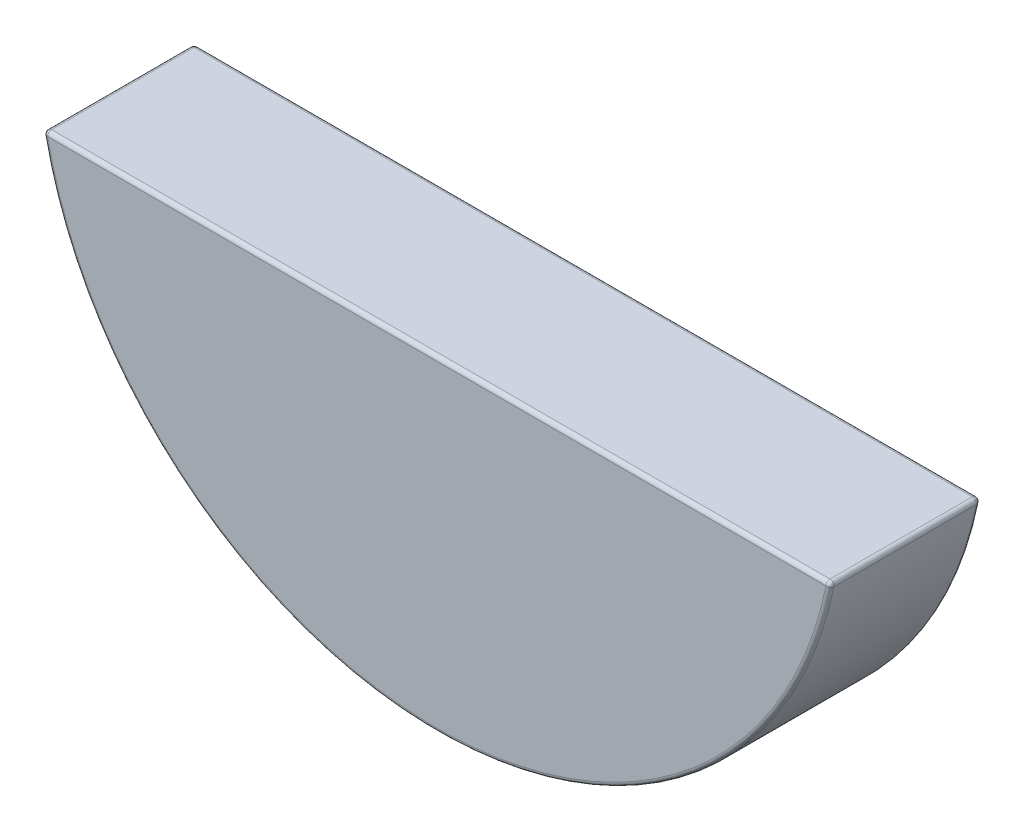
ISO-10303-21;
HEADER;
FILE_DESCRIPTION(('STEP AP214'),'2;1');
FILE_NAME('part.step','',(''),(''),'','','');
FILE_SCHEMA(('AUTOMOTIVE_DESIGN { 1 0 10303 214 1 1 1 1 }'));
ENDSEC;
DATA;
#1=APPLICATION_CONTEXT('core data for automotive mechanical design processes');
#2=APPLICATION_PROTOCOL_DEFINITION('international standard','automotive_design',2000,#1);
#3=PRODUCT_CONTEXT('',#1,'mechanical');
#4=PRODUCT('Part','Part','',(#3));
#5=PRODUCT_RELATED_PRODUCT_CATEGORY('part','',(#4));
#6=PRODUCT_DEFINITION_FORMATION('','',#4);
#7=PRODUCT_DEFINITION_CONTEXT('part definition',#1,'design');
#8=PRODUCT_DEFINITION('design','',#6,#7);
#9=PRODUCT_DEFINITION_SHAPE('','',#8);
#10=(LENGTH_UNIT() NAMED_UNIT(*) SI_UNIT(.MILLI.,.METRE.));
#11=(NAMED_UNIT(*) PLANE_ANGLE_UNIT() SI_UNIT($,.RADIAN.));
#12=(NAMED_UNIT(*) SI_UNIT($,.STERADIAN.) SOLID_ANGLE_UNIT());
#13=UNCERTAINTY_MEASURE_WITH_UNIT(LENGTH_MEASURE(1.E-05),#10,'distance_accuracy_value','');
#14=(GEOMETRIC_REPRESENTATION_CONTEXT(3) GLOBAL_UNCERTAINTY_ASSIGNED_CONTEXT((#13)) GLOBAL_UNIT_ASSIGNED_CONTEXT((#10,
#11,#12)) REPRESENTATION_CONTEXT('',''));
#15=CARTESIAN_POINT('',(0.,0.,0.));
#16=DIRECTION('',(0.,0.,1.));
#17=DIRECTION('',(1.,0.,0.));
#18=AXIS2_PLACEMENT_3D('',#15,#16,#17);
#19=CARTESIAN_POINT('',(0.,0.,2.38125));
#20=DIRECTION('',(0.,0.,-1.));
#21=DIRECTION('',(-1.,0.,0.));
#22=AXIS2_PLACEMENT_3D('',#19,#20,#21);
#23=CYLINDRICAL_SURFACE('',#22,6.35);
#24=DIRECTION('',(0.,0.,-1.));
#25=VECTOR('',#24,1.);
#26=CARTESIAN_POINT('',(6.22170394666927,-1.27,2.38125));
#27=LINE('',#26,#25);
#28=CARTESIAN_POINT('',(6.22170394666927,-1.27,0.0635000000000002));
#29=VERTEX_POINT('',#28);
#30=CARTESIAN_POINT('',(6.22170394666927,-1.27,2.31775));
#31=VERTEX_POINT('',#30);
#32=EDGE_CURVE('E94',#29,#31,#27,.F.);
#33=ORIENTED_EDGE('',*,*,#32,.T.);
#34=CARTESIAN_POINT('',(0.,0.,2.31775));
#35=DIRECTION('',(0.,0.,1.));
#36=DIRECTION('',(1.,0.,0.));
#37=AXIS2_PLACEMENT_3D('',#34,#35,#36);
#38=CIRCLE('',#37,6.35);
#39=CARTESIAN_POINT('',(-6.22170394666927,-1.27,2.31775));
#40=VERTEX_POINT('',#39);
#41=EDGE_CURVE('E126',#31,#40,#38,.F.);
#42=ORIENTED_EDGE('',*,*,#41,.T.);
#43=DIRECTION('',(0.,0.,-1.));
#44=VECTOR('',#43,1.);
#45=CARTESIAN_POINT('',(-6.22170394666927,-1.27,2.38125));
#46=LINE('',#45,#44);
#47=CARTESIAN_POINT('',(-6.22170394666927,-1.27,0.0635000000000002));
#48=VERTEX_POINT('',#47);
#49=EDGE_CURVE('E123',#40,#48,#46,.T.);
#50=ORIENTED_EDGE('',*,*,#49,.T.);
#51=CARTESIAN_POINT('',(0.,0.,0.0635000000000002));
#52=DIRECTION('',(0.,0.,1.));
#53=DIRECTION('',(1.,0.,0.));
#54=AXIS2_PLACEMENT_3D('',#51,#52,#53);
#55=CIRCLE('',#54,6.35);
#56=EDGE_CURVE('E118',#48,#29,#55,.T.);
#57=ORIENTED_EDGE('',*,*,#56,.T.);
#58=EDGE_LOOP('',(#33,#42,#50,#57));
#59=FACE_BOUND('',#58,.T.);
#60=ADVANCED_FACE('F33',(#59),#23,.T.);
#61=CARTESIAN_POINT('',(-6.23677332921439,-1.1938,2.38125));
#62=DIRECTION('',(0.,-1.,0.));
#63=DIRECTION('',(0.,0.,-1.));
#64=AXIS2_PLACEMENT_3D('',#61,#62,#63);
#65=PLANE('',#64);
#66=DIRECTION('',(0.,0.,-1.));
#67=VECTOR('',#66,1.);
#68=CARTESIAN_POINT('',(-6.15948690720258,-1.1938,2.38125));
#69=LINE('',#68,#67);
#70=CARTESIAN_POINT('',(-6.15948690720258,-1.1938,0.0635000000000002));
#71=VERTEX_POINT('',#70);
#72=CARTESIAN_POINT('',(-6.15948690720258,-1.1938,2.31775));
#73=VERTEX_POINT('',#72);
#74=EDGE_CURVE('E111',#71,#73,#69,.F.);
#75=ORIENTED_EDGE('',*,*,#74,.T.);
#76=DIRECTION('',(-1.,0.,0.));
#77=VECTOR('',#76,1.);
#78=CARTESIAN_POINT('',(6.23677332921439,-1.1938,2.31775));
#79=LINE('',#78,#77);
#80=CARTESIAN_POINT('',(6.15948690720258,-1.1938,2.31775));
#81=VERTEX_POINT('',#80);
#82=EDGE_CURVE('E115',#73,#81,#79,.F.);
#83=ORIENTED_EDGE('',*,*,#82,.T.);
#84=DIRECTION('',(0.,0.,-1.));
#85=VECTOR('',#84,1.);
#86=CARTESIAN_POINT('',(6.15948690720258,-1.1938,2.38125));
#87=LINE('',#86,#85);
#88=CARTESIAN_POINT('',(6.15948690720258,-1.1938,0.0635000000000002));
#89=VERTEX_POINT('',#88);
#90=EDGE_CURVE('E92',#81,#89,#87,.T.);
#91=ORIENTED_EDGE('',*,*,#90,.T.);
#92=DIRECTION('',(-1.,0.,0.));
#93=VECTOR('',#92,1.);
#94=CARTESIAN_POINT('',(-6.23677332921439,-1.1938,0.0635000000000002));
#95=LINE('',#94,#93);
#96=EDGE_CURVE('E105',#89,#71,#95,.T.);
#97=ORIENTED_EDGE('',*,*,#96,.T.);
#98=EDGE_LOOP('',(#75,#83,#91,#97));
#99=FACE_BOUND('',#98,.T.);
#100=ADVANCED_FACE('F113',(#99),#65,.F.);
#101=CARTESIAN_POINT('',(0.,0.,2.38125));
#102=DIRECTION('',(0.,0.,1.));
#103=DIRECTION('',(1.,0.,0.));
#104=AXIS2_PLACEMENT_3D('',#101,#102,#103);
#105=PLANE('',#104);
#106=CARTESIAN_POINT('',(0.,0.,2.38125));
#107=DIRECTION('',(0.,0.,1.));
#108=DIRECTION('',(1.,0.,0.));
#109=AXIS2_PLACEMENT_3D('',#106,#107,#108);
#110=CIRCLE('',#109,6.2865);
#111=CARTESIAN_POINT('',(-6.15948690720258,-1.2573,2.38125));
#112=VERTEX_POINT('',#111);
#113=CARTESIAN_POINT('',(6.15948690720258,-1.2573,2.38125));
#114=VERTEX_POINT('',#113);
#115=EDGE_CURVE('E128',#112,#114,#110,.T.);
#116=ORIENTED_EDGE('',*,*,#115,.T.);
#117=DIRECTION('',(-1.,0.,0.));
#118=VECTOR('',#117,1.);
#119=CARTESIAN_POINT('',(-6.23677332921439,-1.2573,2.38125));
#120=LINE('',#119,#118);
#121=EDGE_CURVE('E130',#114,#112,#120,.T.);
#122=ORIENTED_EDGE('',*,*,#121,.T.);
#123=EDGE_LOOP('',(#116,#122));
#124=FACE_BOUND('',#123,.T.);
#125=ADVANCED_FACE('F168',(#124),#105,.T.);
#126=CARTESIAN_POINT('',(0.,0.,0.));
#127=DIRECTION('',(0.,0.,1.));
#128=DIRECTION('',(1.,0.,0.));
#129=AXIS2_PLACEMENT_3D('',#126,#127,#128);
#130=PLANE('',#129);
#131=CARTESIAN_POINT('',(0.,0.,0.));
#132=DIRECTION('',(0.,0.,1.));
#133=DIRECTION('',(1.,0.,0.));
#134=AXIS2_PLACEMENT_3D('',#131,#132,#133);
#135=CIRCLE('',#134,6.2865);
#136=CARTESIAN_POINT('',(6.15948690720258,-1.2573,0.));
#137=VERTEX_POINT('',#136);
#138=CARTESIAN_POINT('',(-6.15948690720258,-1.2573,0.));
#139=VERTEX_POINT('',#138);
#140=EDGE_CURVE('E42',#137,#139,#135,.F.);
#141=ORIENTED_EDGE('',*,*,#140,.T.);
#142=DIRECTION('',(-1.,0.,0.));
#143=VECTOR('',#142,1.);
#144=CARTESIAN_POINT('',(0.,-1.2573,0.));
#145=LINE('',#144,#143);
#146=EDGE_CURVE('E11',#139,#137,#145,.F.);
#147=ORIENTED_EDGE('',*,*,#146,.T.);
#148=EDGE_LOOP('',(#141,#147));
#149=FACE_BOUND('',#148,.T.);
#150=ADVANCED_FACE('F259',(#149),#130,.F.);
#151=CARTESIAN_POINT('',(-6.15948690720258,-1.2573,2.38125));
#152=DIRECTION('',(0.,0.,-1.));
#153=DIRECTION('',(-1.,0.,0.));
#154=AXIS2_PLACEMENT_3D('',#151,#152,#153);
#155=CYLINDRICAL_SURFACE('',#154,0.0635);
#156=CARTESIAN_POINT('',(-6.15948690720258,-1.2573,2.31775));
#157=DIRECTION('',(0.,0.,1.));
#158=DIRECTION('',(1.,0.,0.));
#159=AXIS2_PLACEMENT_3D('',#156,#157,#158);
#160=CIRCLE('',#159,0.0635);
#161=EDGE_CURVE('E37',#73,#40,#160,.T.);
#162=ORIENTED_EDGE('',*,*,#161,.F.);
#163=ORIENTED_EDGE('',*,*,#74,.F.);
#164=CARTESIAN_POINT('',(-6.15948690720258,-1.2573,0.0635000000000002));
#165=DIRECTION('',(0.,0.,-1.));
#166=DIRECTION('',(-1.,0.,0.));
#167=AXIS2_PLACEMENT_3D('',#164,#165,#166);
#168=CIRCLE('',#167,0.0635);
#169=EDGE_CURVE('E149',#48,#71,#168,.T.);
#170=ORIENTED_EDGE('',*,*,#169,.F.);
#171=ORIENTED_EDGE('',*,*,#49,.F.);
#172=EDGE_LOOP('',(#162,#163,#170,#171));
#173=FACE_BOUND('',#172,.T.);
#174=ADVANCED_FACE('F35',(#173),#155,.T.);
#175=CARTESIAN_POINT('',(-6.15948690720258,-1.2573,2.31775));
#176=DIRECTION('',(0.,0.,1.));
#177=DIRECTION('',(1.,0.,0.));
#178=AXIS2_PLACEMENT_3D('',#175,#176,#177);
#179=SPHERICAL_SURFACE('',#178,0.0635);
#180=CARTESIAN_POINT('',(-6.15948690720258,-1.2573,2.31775));
#181=DIRECTION('',(-1.,0.,0.));
#182=DIRECTION('',(0.,-1.,0.));
#183=AXIS2_PLACEMENT_3D('',#180,#181,#182);
#184=CIRCLE('',#183,0.0635);
#185=EDGE_CURVE('E144',#73,#112,#184,.F.);
#186=ORIENTED_EDGE('',*,*,#185,.F.);
#187=ORIENTED_EDGE('',*,*,#161,.T.);
#188=CARTESIAN_POINT('',(-6.15948690720258,-1.2573,2.31775));
#189=DIRECTION('',(-0.2,0.979795897113271,0.));
#190=DIRECTION('',(-0.979795897113271,-0.2,0.));
#191=AXIS2_PLACEMENT_3D('',#188,#189,#190);
#192=CIRCLE('',#191,0.0635);
#193=EDGE_CURVE('E147',#112,#40,#192,.F.);
#194=ORIENTED_EDGE('',*,*,#193,.F.);
#195=EDGE_LOOP('',(#186,#187,#194));
#196=FACE_BOUND('',#195,.T.);
#197=ADVANCED_FACE('F159',(#196),#179,.T.);
#198=CARTESIAN_POINT('',(-6.15948690720258,-1.2573,0.0635));
#199=DIRECTION('',(0.,0.,1.));
#200=DIRECTION('',(1.,0.,0.));
#201=AXIS2_PLACEMENT_3D('',#198,#199,#200);
#202=SPHERICAL_SURFACE('',#201,0.0635);
#203=CARTESIAN_POINT('',(-6.15948690720258,-1.2573,0.0635));
#204=DIRECTION('',(-0.199999999999994,0.979795897113273,0.));
#205=DIRECTION('',(-0.979795897113273,-0.199999999999994,0.));
#206=AXIS2_PLACEMENT_3D('',#203,#204,#205);
#207=CIRCLE('',#206,0.0635);
#208=EDGE_CURVE('E141',#48,#139,#207,.F.);
#209=ORIENTED_EDGE('',*,*,#208,.F.);
#210=ORIENTED_EDGE('',*,*,#169,.T.);
#211=CARTESIAN_POINT('',(-6.15948690720258,-1.2573,0.0635000000000002));
#212=DIRECTION('',(-1.,0.,0.));
#213=DIRECTION('',(0.,0.,1.));
#214=AXIS2_PLACEMENT_3D('',#211,#212,#213);
#215=CIRCLE('',#214,0.0635);
#216=EDGE_CURVE('E108',#139,#71,#215,.F.);
#217=ORIENTED_EDGE('',*,*,#216,.F.);
#218=EDGE_LOOP('',(#209,#210,#217));
#219=FACE_BOUND('',#218,.T.);
#220=ADVANCED_FACE('F235',(#219),#202,.T.);
#221=CARTESIAN_POINT('',(0.,0.,2.31775));
#222=DIRECTION('',(0.,0.,1.));
#223=DIRECTION('',(1.,0.,0.));
#224=AXIS2_PLACEMENT_3D('',#221,#222,#223);
#225=TOROIDAL_SURFACE('',#224,6.2865,0.0635);
#226=ORIENTED_EDGE('',*,*,#193,.T.);
#227=ORIENTED_EDGE('',*,*,#41,.F.);
#228=CARTESIAN_POINT('',(6.15948690720258,-1.2573,2.31775));
#229=DIRECTION('',(0.199999999999994,0.979795897113272,0.));
#230=DIRECTION('',(-0.979795897113273,0.199999999999994,0.));
#231=AXIS2_PLACEMENT_3D('',#228,#229,#230);
#232=CIRCLE('',#231,0.0635);
#233=EDGE_CURVE('E138',#114,#31,#232,.T.);
#234=ORIENTED_EDGE('',*,*,#233,.F.);
#235=ORIENTED_EDGE('',*,*,#115,.F.);
#236=EDGE_LOOP('',(#226,#227,#234,#235));
#237=FACE_BOUND('',#236,.T.);
#238=ADVANCED_FACE('F164',(#237),#225,.T.);
#239=CARTESIAN_POINT('',(0.,-1.2573,2.31775));
#240=DIRECTION('',(1.,0.,0.));
#241=DIRECTION('',(0.,0.,-1.));
#242=AXIS2_PLACEMENT_3D('',#239,#240,#241);
#243=CYLINDRICAL_SURFACE('',#242,0.0635);
#244=ORIENTED_EDGE('',*,*,#185,.T.);
#245=ORIENTED_EDGE('',*,*,#121,.F.);
#246=CARTESIAN_POINT('',(6.15948690720258,-1.2573,2.31775));
#247=DIRECTION('',(1.,0.,0.));
#248=DIRECTION('',(0.,0.,-1.));
#249=AXIS2_PLACEMENT_3D('',#246,#247,#248);
#250=CIRCLE('',#249,0.0635);
#251=EDGE_CURVE('E102',#81,#114,#250,.T.);
#252=ORIENTED_EDGE('',*,*,#251,.F.);
#253=ORIENTED_EDGE('',*,*,#82,.F.);
#254=EDGE_LOOP('',(#244,#245,#252,#253));
#255=FACE_BOUND('',#254,.T.);
#256=ADVANCED_FACE('F170',(#255),#243,.T.);
#257=CARTESIAN_POINT('',(-6.23677332921439,-1.2573,0.0635000000000002));
#258=DIRECTION('',(-1.,0.,0.));
#259=DIRECTION('',(0.,0.,1.));
#260=AXIS2_PLACEMENT_3D('',#257,#258,#259);
#261=CYLINDRICAL_SURFACE('',#260,0.0635);
#262=ORIENTED_EDGE('',*,*,#216,.T.);
#263=ORIENTED_EDGE('',*,*,#96,.F.);
#264=CARTESIAN_POINT('',(6.15948690720258,-1.2573,0.0635));
#265=DIRECTION('',(1.,0.,0.));
#266=DIRECTION('',(0.,1.,0.));
#267=AXIS2_PLACEMENT_3D('',#264,#265,#266);
#268=CIRCLE('',#267,0.0635);
#269=EDGE_CURVE('E97',#137,#89,#268,.T.);
#270=ORIENTED_EDGE('',*,*,#269,.F.);
#271=ORIENTED_EDGE('',*,*,#146,.F.);
#272=EDGE_LOOP('',(#262,#263,#270,#271));
#273=FACE_BOUND('',#272,.T.);
#274=ADVANCED_FACE('F106',(#273),#261,.T.);
#275=CARTESIAN_POINT('',(0.,0.,0.0635000000000002));
#276=DIRECTION('',(0.,0.,1.));
#277=DIRECTION('',(1.,0.,0.));
#278=AXIS2_PLACEMENT_3D('',#275,#276,#277);
#279=TOROIDAL_SURFACE('',#278,6.2865,0.0635);
#280=ORIENTED_EDGE('',*,*,#208,.T.);
#281=ORIENTED_EDGE('',*,*,#140,.F.);
#282=CARTESIAN_POINT('',(6.15948690720258,-1.2573,0.0635000000000002));
#283=DIRECTION('',(0.2,0.979795897113271,0.));
#284=DIRECTION('',(-0.979795897113271,0.2,0.));
#285=AXIS2_PLACEMENT_3D('',#282,#283,#284);
#286=CIRCLE('',#285,0.0635);
#287=EDGE_CURVE('E55',#29,#137,#286,.T.);
#288=ORIENTED_EDGE('',*,*,#287,.F.);
#289=ORIENTED_EDGE('',*,*,#56,.F.);
#290=EDGE_LOOP('',(#280,#281,#288,#289));
#291=FACE_BOUND('',#290,.T.);
#292=ADVANCED_FACE('F175',(#291),#279,.T.);
#293=CARTESIAN_POINT('',(6.15948690720258,-1.2573,2.31775));
#294=DIRECTION('',(0.,0.,1.));
#295=DIRECTION('',(1.,0.,0.));
#296=AXIS2_PLACEMENT_3D('',#293,#294,#295);
#297=SPHERICAL_SURFACE('',#296,0.0635);
#298=ORIENTED_EDGE('',*,*,#251,.T.);
#299=ORIENTED_EDGE('',*,*,#233,.T.);
#300=CARTESIAN_POINT('',(6.15948690720258,-1.2573,2.31775));
#301=DIRECTION('',(0.,0.,1.));
#302=DIRECTION('',(1.,0.,0.));
#303=AXIS2_PLACEMENT_3D('',#300,#301,#302);
#304=CIRCLE('',#303,0.0635);
#305=EDGE_CURVE('E95',#81,#31,#304,.F.);
#306=ORIENTED_EDGE('',*,*,#305,.F.);
#307=EDGE_LOOP('',(#298,#299,#306));
#308=FACE_BOUND('',#307,.T.);
#309=ADVANCED_FACE('F173',(#308),#297,.T.);
#310=CARTESIAN_POINT('',(6.15948690720258,-1.2573,0.0635));
#311=DIRECTION('',(0.,0.,1.));
#312=DIRECTION('',(1.,0.,0.));
#313=AXIS2_PLACEMENT_3D('',#310,#311,#312);
#314=SPHERICAL_SURFACE('',#313,0.0635);
#315=ORIENTED_EDGE('',*,*,#287,.T.);
#316=ORIENTED_EDGE('',*,*,#269,.T.);
#317=CARTESIAN_POINT('',(6.15948690720258,-1.2573,0.0635000000000002));
#318=DIRECTION('',(0.,0.,-1.));
#319=DIRECTION('',(-1.,0.,0.));
#320=AXIS2_PLACEMENT_3D('',#317,#318,#319);
#321=CIRCLE('',#320,0.0635);
#322=EDGE_CURVE('E89',#29,#89,#321,.F.);
#323=ORIENTED_EDGE('',*,*,#322,.F.);
#324=EDGE_LOOP('',(#315,#316,#323));
#325=FACE_BOUND('',#324,.T.);
#326=ADVANCED_FACE('F99',(#325),#314,.T.);
#327=CARTESIAN_POINT('',(6.15948690720258,-1.2573,2.38125));
#328=DIRECTION('',(0.,0.,-1.));
#329=DIRECTION('',(-1.,0.,0.));
#330=AXIS2_PLACEMENT_3D('',#327,#328,#329);
#331=CYLINDRICAL_SURFACE('',#330,0.0635);
#332=ORIENTED_EDGE('',*,*,#305,.T.);
#333=ORIENTED_EDGE('',*,*,#32,.F.);
#334=ORIENTED_EDGE('',*,*,#322,.T.);
#335=ORIENTED_EDGE('',*,*,#90,.F.);
#336=EDGE_LOOP('',(#332,#333,#334,#335));
#337=FACE_BOUND('',#336,.T.);
#338=ADVANCED_FACE('F90',(#337),#331,.T.);
#339=CLOSED_SHELL('',(#60,#100,#125,#150,#174,#197,#220,#238,#256,#274,#292,#309,#326,#338));
#340=MANIFOLD_SOLID_BREP('B2',#339);
#341=ADVANCED_BREP_SHAPE_REPRESENTATION('',(#18,#340),#14);
#342=SHAPE_DEFINITION_REPRESENTATION(#9,#341);
ENDSEC;
END-ISO-10303-21;
